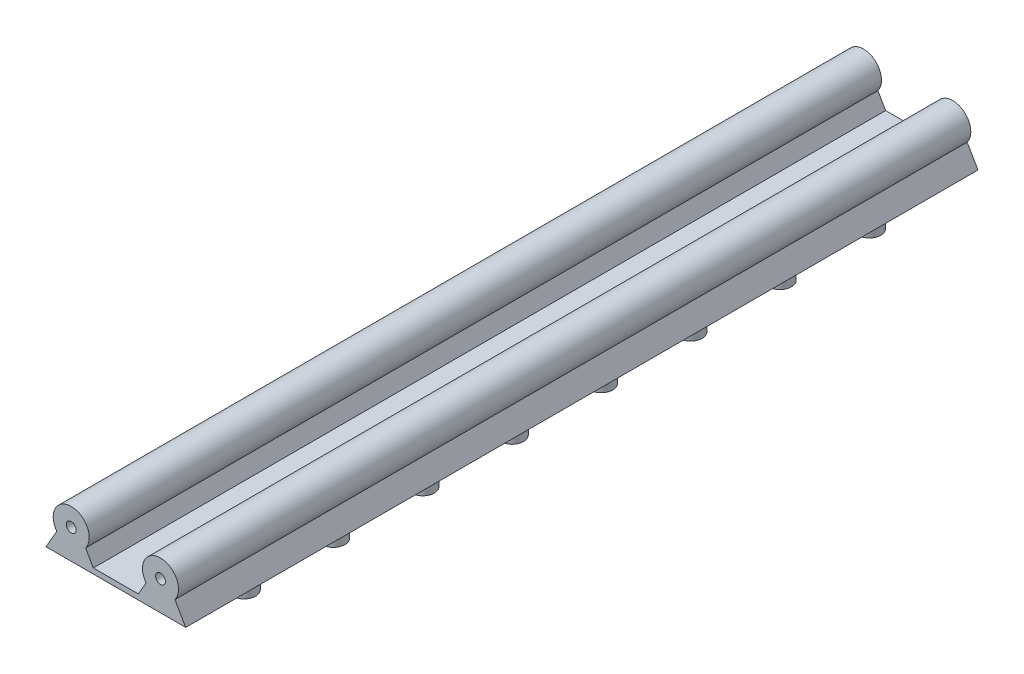
ISO-10303-21;
HEADER;
FILE_DESCRIPTION(('STEP AP214'),'2;1');
FILE_NAME('part.step','',(''),(''),'','','');
FILE_SCHEMA(('AUTOMOTIVE_DESIGN { 1 0 10303 214 1 1 1 1 }'));
ENDSEC;
DATA;
#1=APPLICATION_CONTEXT('core data for automotive mechanical design processes');
#2=APPLICATION_PROTOCOL_DEFINITION('international standard','automotive_design',2000,#1);
#3=PRODUCT_CONTEXT('',#1,'mechanical');
#4=PRODUCT('Part','Part','',(#3));
#5=PRODUCT_RELATED_PRODUCT_CATEGORY('part','',(#4));
#6=PRODUCT_DEFINITION_FORMATION('','',#4);
#7=PRODUCT_DEFINITION_CONTEXT('part definition',#1,'design');
#8=PRODUCT_DEFINITION('design','',#6,#7);
#9=PRODUCT_DEFINITION_SHAPE('','',#8);
#10=(LENGTH_UNIT() NAMED_UNIT(*) SI_UNIT(.MILLI.,.METRE.));
#11=(NAMED_UNIT(*) PLANE_ANGLE_UNIT() SI_UNIT($,.RADIAN.));
#12=(NAMED_UNIT(*) SI_UNIT($,.STERADIAN.) SOLID_ANGLE_UNIT());
#13=UNCERTAINTY_MEASURE_WITH_UNIT(LENGTH_MEASURE(1.E-05),#10,'distance_accuracy_value','');
#14=(GEOMETRIC_REPRESENTATION_CONTEXT(3) GLOBAL_UNCERTAINTY_ASSIGNED_CONTEXT((#13)) GLOBAL_UNIT_ASSIGNED_CONTEXT((#10,
#11,#12)) REPRESENTATION_CONTEXT('',''));
#15=CARTESIAN_POINT('',(0.,0.,0.));
#16=DIRECTION('',(0.,0.,1.));
#17=DIRECTION('',(1.,0.,0.));
#18=AXIS2_PLACEMENT_3D('',#15,#16,#17);
#19=CARTESIAN_POINT('',(0.,0.,220.));
#20=DIRECTION('',(0.,0.,-1.));
#21=DIRECTION('',(-1.,0.,0.));
#22=AXIS2_PLACEMENT_3D('',#19,#20,#21);
#23=CYLINDRICAL_SURFACE('',#22,5.);
#24=CARTESIAN_POINT('',(0.,0.,0.));
#25=DIRECTION('',(0.,0.,1.));
#26=DIRECTION('',(1.,0.,0.));
#27=AXIS2_PLACEMENT_3D('',#24,#25,#26);
#28=CIRCLE('',#27,5.);
#29=CARTESIAN_POINT('',(4.,-3.,0.));
#30=VERTEX_POINT('',#29);
#31=CARTESIAN_POINT('',(-4.,-3.,0.));
#32=VERTEX_POINT('',#31);
#33=EDGE_CURVE('E199',#30,#32,#28,.T.);
#34=ORIENTED_EDGE('',*,*,#33,.T.);
#35=DIRECTION('',(0.,0.,-1.));
#36=VECTOR('',#35,1.);
#37=CARTESIAN_POINT('',(-4.,-3.,220.));
#38=LINE('',#37,#36);
#39=CARTESIAN_POINT('',(-4.,-3.,220.));
#40=VERTEX_POINT('',#39);
#41=EDGE_CURVE('E221',#40,#32,#38,.T.);
#42=ORIENTED_EDGE('',*,*,#41,.F.);
#43=CARTESIAN_POINT('',(0.,0.,220.));
#44=DIRECTION('',(0.,0.,1.));
#45=DIRECTION('',(1.,0.,0.));
#46=AXIS2_PLACEMENT_3D('',#43,#44,#45);
#47=CIRCLE('',#46,5.);
#48=CARTESIAN_POINT('',(4.,-3.,220.));
#49=VERTEX_POINT('',#48);
#50=EDGE_CURVE('E200',#49,#40,#47,.T.);
#51=ORIENTED_EDGE('',*,*,#50,.F.);
#52=DIRECTION('',(0.,0.,-1.));
#53=VECTOR('',#52,1.);
#54=CARTESIAN_POINT('',(4.,-3.,220.));
#55=LINE('',#54,#53);
#56=EDGE_CURVE('E209',#49,#30,#55,.T.);
#57=ORIENTED_EDGE('',*,*,#56,.T.);
#58=EDGE_LOOP('',(#34,#42,#51,#57));
#59=FACE_BOUND('',#58,.T.);
#60=ADVANCED_FACE('F45',(#59),#23,.T.);
#61=CARTESIAN_POINT('',(-1.70096189432334,0.982050807568877,220.));
#62=DIRECTION('',(0.866025403784438,-0.5,0.));
#63=DIRECTION('',(0.5,0.866025403784439,0.));
#64=AXIS2_PLACEMENT_3D('',#61,#62,#63);
#65=PLANE('',#64);
#66=DIRECTION('',(-0.5,-0.866025403784439,0.));
#67=VECTOR('',#66,1.);
#68=CARTESIAN_POINT('',(-1.70096189432334,0.982050807568877,0.));
#69=LINE('',#68,#67);
#70=CARTESIAN_POINT('',(-7.,-8.19615242270663,0.));
#71=VERTEX_POINT('',#70);
#72=EDGE_CURVE('E212',#32,#71,#69,.T.);
#73=ORIENTED_EDGE('',*,*,#72,.T.);
#74=DIRECTION('',(0.,0.,-1.));
#75=VECTOR('',#74,1.);
#76=CARTESIAN_POINT('',(-7.,-8.19615242270663,220.));
#77=LINE('',#76,#75);
#78=CARTESIAN_POINT('',(-7.,-8.19615242270663,220.));
#79=VERTEX_POINT('',#78);
#80=EDGE_CURVE('E218',#79,#71,#77,.T.);
#81=ORIENTED_EDGE('',*,*,#80,.F.);
#82=DIRECTION('',(-0.5,-0.866025403784439,0.));
#83=VECTOR('',#82,1.);
#84=CARTESIAN_POINT('',(-1.70096189432334,0.982050807568877,220.));
#85=LINE('',#84,#83);
#86=EDGE_CURVE('E203',#40,#79,#85,.T.);
#87=ORIENTED_EDGE('',*,*,#86,.F.);
#88=ORIENTED_EDGE('',*,*,#41,.T.);
#89=EDGE_LOOP('',(#73,#81,#87,#88));
#90=FACE_BOUND('',#89,.T.);
#91=ADVANCED_FACE('F250',(#90),#65,.F.);
#92=CARTESIAN_POINT('',(0.,-8.19615242270663,220.));
#93=DIRECTION('',(0.,1.,0.));
#94=DIRECTION('',(0.,0.,1.));
#95=AXIS2_PLACEMENT_3D('',#92,#93,#94);
#96=PLANE('',#95);
#97=DIRECTION('',(0.,0.,-1.));
#98=VECTOR('',#97,1.);
#99=CARTESIAN_POINT('',(31.8,-8.19615242270663,220.));
#100=LINE('',#99,#98);
#101=CARTESIAN_POINT('',(31.8,-8.19615242270663,220.));
#102=VERTEX_POINT('',#101);
#103=CARTESIAN_POINT('',(31.8,-8.19615242270663,0.));
#104=VERTEX_POINT('',#103);
#105=EDGE_CURVE('E119',#102,#104,#100,.T.);
#106=ORIENTED_EDGE('',*,*,#105,.F.);
#107=DIRECTION('',(1.,0.,0.));
#108=VECTOR('',#107,1.);
#109=CARTESIAN_POINT('',(0.,-8.19615242270663,220.));
#110=LINE('',#109,#108);
#111=EDGE_CURVE('E206',#79,#102,#110,.T.);
#112=ORIENTED_EDGE('',*,*,#111,.F.);
#113=ORIENTED_EDGE('',*,*,#80,.T.);
#114=DIRECTION('',(1.,0.,0.));
#115=VECTOR('',#114,1.);
#116=CARTESIAN_POINT('',(0.,-8.19615242270663,0.));
#117=LINE('',#116,#115);
#118=EDGE_CURVE('E214',#71,#104,#117,.T.);
#119=ORIENTED_EDGE('',*,*,#118,.T.);
#120=EDGE_LOOP('',(#106,#112,#113,#119));
#121=FACE_BOUND('',#120,.T.);
#122=CARTESIAN_POINT('',(24.8000000000018,-8.19615242270663,23.2000000000003));
#123=DIRECTION('',(0.,1.,0.));
#124=DIRECTION('',(0.,0.,1.));
#125=AXIS2_PLACEMENT_3D('',#122,#123,#124);
#126=CIRCLE('',#125,3.2);
#127=CARTESIAN_POINT('',(24.8000000000018,-8.19615242270663,26.4000000000003));
#128=VERTEX_POINT('',#127);
#129=EDGE_CURVE('E165',#128,#128,#126,.F.);
#130=ORIENTED_EDGE('',*,*,#129,.F.);
#131=EDGE_LOOP('',(#130));
#132=FACE_BOUND('',#131,.T.);
#133=CARTESIAN_POINT('',(24.8000000000015,-8.19615242270663,48.0000000000003));
#134=DIRECTION('',(0.,1.,0.));
#135=DIRECTION('',(0.,0.,1.));
#136=AXIS2_PLACEMENT_3D('',#133,#134,#135);
#137=CIRCLE('',#136,3.2);
#138=CARTESIAN_POINT('',(24.8000000000015,-8.19615242270663,51.2000000000003));
#139=VERTEX_POINT('',#138);
#140=EDGE_CURVE('E162',#139,#139,#137,.F.);
#141=ORIENTED_EDGE('',*,*,#140,.F.);
#142=EDGE_LOOP('',(#141));
#143=FACE_BOUND('',#142,.T.);
#144=CARTESIAN_POINT('',(24.8000000000013,-8.19615242270663,72.8000000000003));
#145=DIRECTION('',(0.,1.,0.));
#146=DIRECTION('',(0.,0.,1.));
#147=AXIS2_PLACEMENT_3D('',#144,#145,#146);
#148=CIRCLE('',#147,3.2);
#149=CARTESIAN_POINT('',(24.8000000000013,-8.19615242270663,76.0000000000003));
#150=VERTEX_POINT('',#149);
#151=EDGE_CURVE('E159',#150,#150,#148,.F.);
#152=ORIENTED_EDGE('',*,*,#151,.F.);
#153=EDGE_LOOP('',(#152));
#154=FACE_BOUND('',#153,.T.);
#155=CARTESIAN_POINT('',(24.800000000001,-8.19615242270663,97.6000000000003));
#156=DIRECTION('',(0.,1.,0.));
#157=DIRECTION('',(0.,0.,1.));
#158=AXIS2_PLACEMENT_3D('',#155,#156,#157);
#159=CIRCLE('',#158,3.2);
#160=CARTESIAN_POINT('',(24.800000000001,-8.19615242270663,100.8));
#161=VERTEX_POINT('',#160);
#162=EDGE_CURVE('E156',#161,#161,#159,.F.);
#163=ORIENTED_EDGE('',*,*,#162,.F.);
#164=EDGE_LOOP('',(#163));
#165=FACE_BOUND('',#164,.T.);
#166=CARTESIAN_POINT('',(24.8000000000008,-8.19615242270663,122.4));
#167=DIRECTION('',(0.,1.,0.));
#168=DIRECTION('',(0.,0.,1.));
#169=AXIS2_PLACEMENT_3D('',#166,#167,#168);
#170=CIRCLE('',#169,3.19999999999999);
#171=CARTESIAN_POINT('',(24.8000000000008,-8.19615242270663,125.6));
#172=VERTEX_POINT('',#171);
#173=EDGE_CURVE('E153',#172,#172,#170,.F.);
#174=ORIENTED_EDGE('',*,*,#173,.F.);
#175=EDGE_LOOP('',(#174));
#176=FACE_BOUND('',#175,.T.);
#177=CARTESIAN_POINT('',(24.8000000000005,-8.19615242270663,147.2));
#178=DIRECTION('',(0.,1.,0.));
#179=DIRECTION('',(0.,0.,1.));
#180=AXIS2_PLACEMENT_3D('',#177,#178,#179);
#181=CIRCLE('',#180,3.20000000000001);
#182=CARTESIAN_POINT('',(24.8000000000005,-8.19615242270663,150.4));
#183=VERTEX_POINT('',#182);
#184=EDGE_CURVE('E150',#183,#183,#181,.F.);
#185=ORIENTED_EDGE('',*,*,#184,.F.);
#186=EDGE_LOOP('',(#185));
#187=FACE_BOUND('',#186,.T.);
#188=CARTESIAN_POINT('',(24.8000000000003,-8.19615242270663,172.));
#189=DIRECTION('',(0.,1.,0.));
#190=DIRECTION('',(0.,0.,1.));
#191=AXIS2_PLACEMENT_3D('',#188,#189,#190);
#192=CIRCLE('',#191,3.2);
#193=CARTESIAN_POINT('',(24.8000000000003,-8.19615242270663,175.2));
#194=VERTEX_POINT('',#193);
#195=EDGE_CURVE('E139',#194,#194,#192,.F.);
#196=ORIENTED_EDGE('',*,*,#195,.F.);
#197=EDGE_LOOP('',(#196));
#198=FACE_BOUND('',#197,.T.);
#199=CARTESIAN_POINT('',(24.8,-8.19615242270663,196.8));
#200=DIRECTION('',(0.,1.,0.));
#201=DIRECTION('',(0.,0.,1.));
#202=AXIS2_PLACEMENT_3D('',#199,#200,#201);
#203=CIRCLE('',#202,3.2);
#204=CARTESIAN_POINT('',(24.8,-8.19615242270663,200.));
#205=VERTEX_POINT('',#204);
#206=EDGE_CURVE('E136',#205,#205,#203,.F.);
#207=ORIENTED_EDGE('',*,*,#206,.F.);
#208=EDGE_LOOP('',(#207));
#209=FACE_BOUND('',#208,.T.);
#210=CARTESIAN_POINT('',(0.,-8.19615242270663,196.8));
#211=DIRECTION('',(0.,1.,0.));
#212=DIRECTION('',(0.,0.,1.));
#213=AXIS2_PLACEMENT_3D('',#210,#211,#212);
#214=CIRCLE('',#213,3.20000000000001);
#215=CARTESIAN_POINT('',(0.,-8.19615242270663,200.));
#216=VERTEX_POINT('',#215);
#217=EDGE_CURVE('E224',#216,#216,#214,.F.);
#218=ORIENTED_EDGE('',*,*,#217,.F.);
#219=EDGE_LOOP('',(#218));
#220=FACE_BOUND('',#219,.T.);
#221=CARTESIAN_POINT('',(2.58247649578986E-13,-8.19615242270663,172.));
#222=DIRECTION('',(0.,1.,0.));
#223=DIRECTION('',(0.,0.,1.));
#224=AXIS2_PLACEMENT_3D('',#221,#222,#223);
#225=CIRCLE('',#224,3.20000000000001);
#226=CARTESIAN_POINT('',(2.58247649578986E-13,-8.19615242270663,175.2));
#227=VERTEX_POINT('',#226);
#228=EDGE_CURVE('E227',#227,#227,#225,.F.);
#229=ORIENTED_EDGE('',*,*,#228,.F.);
#230=EDGE_LOOP('',(#229));
#231=FACE_BOUND('',#230,.T.);
#232=CARTESIAN_POINT('',(5.16495299157972E-13,-8.19615242270663,147.2));
#233=DIRECTION('',(0.,1.,0.));
#234=DIRECTION('',(0.,0.,1.));
#235=AXIS2_PLACEMENT_3D('',#232,#233,#234);
#236=CIRCLE('',#235,3.20000000000001);
#237=CARTESIAN_POINT('',(5.16495299157972E-13,-8.19615242270663,150.4));
#238=VERTEX_POINT('',#237);
#239=EDGE_CURVE('E230',#238,#238,#236,.F.);
#240=ORIENTED_EDGE('',*,*,#239,.F.);
#241=EDGE_LOOP('',(#240));
#242=FACE_BOUND('',#241,.T.);
#243=CARTESIAN_POINT('',(7.74742948736958E-13,-8.19615242270663,122.4));
#244=DIRECTION('',(0.,1.,0.));
#245=DIRECTION('',(0.,0.,1.));
#246=AXIS2_PLACEMENT_3D('',#243,#244,#245);
#247=CIRCLE('',#246,3.2);
#248=CARTESIAN_POINT('',(7.74742948736958E-13,-8.19615242270663,125.6));
#249=VERTEX_POINT('',#248);
#250=EDGE_CURVE('E233',#249,#249,#247,.F.);
#251=ORIENTED_EDGE('',*,*,#250,.F.);
#252=EDGE_LOOP('',(#251));
#253=FACE_BOUND('',#252,.T.);
#254=CARTESIAN_POINT('',(1.03299059831594E-12,-8.19615242270663,97.5999999999999));
#255=DIRECTION('',(0.,1.,0.));
#256=DIRECTION('',(0.,0.,1.));
#257=AXIS2_PLACEMENT_3D('',#254,#255,#256);
#258=CIRCLE('',#257,3.2);
#259=CARTESIAN_POINT('',(1.03299059831594E-12,-8.19615242270663,100.8));
#260=VERTEX_POINT('',#259);
#261=EDGE_CURVE('E236',#260,#260,#258,.F.);
#262=ORIENTED_EDGE('',*,*,#261,.F.);
#263=EDGE_LOOP('',(#262));
#264=FACE_BOUND('',#263,.T.);
#265=CARTESIAN_POINT('',(1.29123824789493E-12,-8.19615242270663,72.7999999999999));
#266=DIRECTION('',(0.,1.,0.));
#267=DIRECTION('',(0.,0.,1.));
#268=AXIS2_PLACEMENT_3D('',#265,#266,#267);
#269=CIRCLE('',#268,3.2);
#270=CARTESIAN_POINT('',(1.29123824789493E-12,-8.19615242270663,75.9999999999999));
#271=VERTEX_POINT('',#270);
#272=EDGE_CURVE('E239',#271,#271,#269,.F.);
#273=ORIENTED_EDGE('',*,*,#272,.F.);
#274=EDGE_LOOP('',(#273));
#275=FACE_BOUND('',#274,.T.);
#276=CARTESIAN_POINT('',(1.54948589747392E-12,-8.19615242270663,48.));
#277=DIRECTION('',(0.,1.,0.));
#278=DIRECTION('',(0.,0.,1.));
#279=AXIS2_PLACEMENT_3D('',#276,#277,#278);
#280=CIRCLE('',#279,3.2);
#281=CARTESIAN_POINT('',(1.54948589747392E-12,-8.19615242270663,51.2));
#282=VERTEX_POINT('',#281);
#283=EDGE_CURVE('E52',#282,#282,#280,.F.);
#284=ORIENTED_EDGE('',*,*,#283,.F.);
#285=EDGE_LOOP('',(#284));
#286=FACE_BOUND('',#285,.T.);
#287=CARTESIAN_POINT('',(1.8077335470529E-12,-8.19615242270663,23.2));
#288=DIRECTION('',(0.,1.,0.));
#289=DIRECTION('',(0.,0.,1.));
#290=AXIS2_PLACEMENT_3D('',#287,#288,#289);
#291=CIRCLE('',#290,3.2);
#292=CARTESIAN_POINT('',(1.8077335470529E-12,-8.19615242270663,26.4));
#293=VERTEX_POINT('',#292);
#294=EDGE_CURVE('E11',#293,#293,#291,.F.);
#295=ORIENTED_EDGE('',*,*,#294,.F.);
#296=EDGE_LOOP('',(#295));
#297=FACE_BOUND('',#296,.T.);
#298=ADVANCED_FACE('F246',(#121,#132,#143,#154,#165,#176,#187,#198,#209,#220,#231,#242,#253,
#264,#275,#286,#297),#96,.F.);
#299=CARTESIAN_POINT('',(1.70096189432334,0.982050807568877,220.));
#300=DIRECTION('',(0.866025403784438,0.5,0.));
#301=DIRECTION('',(-0.5,0.866025403784439,0.));
#302=AXIS2_PLACEMENT_3D('',#299,#300,#301);
#303=PLANE('',#302);
#304=DIRECTION('',(0.,0.,1.));
#305=VECTOR('',#304,1.);
#306=CARTESIAN_POINT('',(6.15,-6.72390923627308,0.));
#307=LINE('',#306,#305);
#308=CARTESIAN_POINT('',(6.15,-6.72390923627308,0.));
#309=VERTEX_POINT('',#308);
#310=CARTESIAN_POINT('',(6.15,-6.72390923627308,220.));
#311=VERTEX_POINT('',#310);
#312=EDGE_CURVE('E63',#309,#311,#307,.T.);
#313=ORIENTED_EDGE('',*,*,#312,.F.);
#314=DIRECTION('',(0.5,-0.866025403784439,0.));
#315=VECTOR('',#314,1.);
#316=CARTESIAN_POINT('',(1.70096189432334,0.982050807568877,0.));
#317=LINE('',#316,#315);
#318=EDGE_CURVE('E204',#30,#309,#317,.T.);
#319=ORIENTED_EDGE('',*,*,#318,.F.);
#320=ORIENTED_EDGE('',*,*,#56,.F.);
#321=DIRECTION('',(0.5,-0.866025403784439,0.));
#322=VECTOR('',#321,1.);
#323=CARTESIAN_POINT('',(1.70096189432334,0.982050807568877,220.));
#324=LINE('',#323,#322);
#325=EDGE_CURVE('E59',#49,#311,#324,.T.);
#326=ORIENTED_EDGE('',*,*,#325,.T.);
#327=EDGE_LOOP('',(#313,#319,#320,#326));
#328=FACE_BOUND('',#327,.T.);
#329=ADVANCED_FACE('F249',(#328),#303,.T.);
#330=CARTESIAN_POINT('',(0.,0.,220.));
#331=DIRECTION('',(0.,0.,1.));
#332=DIRECTION('',(1.,0.,0.));
#333=AXIS2_PLACEMENT_3D('',#330,#331,#332);
#334=PLANE('',#333);
#335=CARTESIAN_POINT('',(0.,0.,220.));
#336=DIRECTION('',(0.,0.,1.));
#337=DIRECTION('',(1.,0.,0.));
#338=AXIS2_PLACEMENT_3D('',#335,#336,#337);
#339=CIRCLE('',#338,1.37);
#340=CARTESIAN_POINT('',(1.37,0.,220.));
#341=VERTEX_POINT('',#340);
#342=EDGE_CURVE('E399',#341,#341,#339,.T.);
#343=ORIENTED_EDGE('',*,*,#342,.F.);
#344=EDGE_LOOP('',(#343));
#345=FACE_BOUND('',#344,.T.);
#346=CARTESIAN_POINT('',(24.8,0.,220.));
#347=DIRECTION('',(0.,0.,1.));
#348=DIRECTION('',(1.,0.,0.));
#349=AXIS2_PLACEMENT_3D('',#346,#347,#348);
#350=CIRCLE('',#349,1.37);
#351=CARTESIAN_POINT('',(26.17,0.,220.));
#352=VERTEX_POINT('',#351);
#353=EDGE_CURVE('E405',#352,#352,#350,.T.);
#354=ORIENTED_EDGE('',*,*,#353,.F.);
#355=EDGE_LOOP('',(#354));
#356=FACE_BOUND('',#355,.T.);
#357=DIRECTION('',(-0.5,-0.866025403784439,0.));
#358=VECTOR('',#357,1.);
#359=CARTESIAN_POINT('',(20.8,-3.,220.));
#360=LINE('',#359,#358);
#361=CARTESIAN_POINT('',(20.8,-3.,220.));
#362=VERTEX_POINT('',#361);
#363=CARTESIAN_POINT('',(18.65,-6.72390923627309,220.));
#364=VERTEX_POINT('',#363);
#365=EDGE_CURVE('E114',#362,#364,#360,.T.);
#366=ORIENTED_EDGE('',*,*,#365,.T.);
#367=DIRECTION('',(-1.,0.,0.));
#368=VECTOR('',#367,1.);
#369=CARTESIAN_POINT('',(6.15,-6.72390923627308,220.));
#370=LINE('',#369,#368);
#371=EDGE_CURVE('E168',#364,#311,#370,.T.);
#372=ORIENTED_EDGE('',*,*,#371,.T.);
#373=ORIENTED_EDGE('',*,*,#325,.F.);
#374=ORIENTED_EDGE('',*,*,#50,.T.);
#375=ORIENTED_EDGE('',*,*,#86,.T.);
#376=ORIENTED_EDGE('',*,*,#111,.T.);
#377=DIRECTION('',(0.5,-0.866025403784438,0.));
#378=VECTOR('',#377,1.);
#379=CARTESIAN_POINT('',(28.8,-3.,220.));
#380=LINE('',#379,#378);
#381=CARTESIAN_POINT('',(28.8,-3.,220.));
#382=VERTEX_POINT('',#381);
#383=EDGE_CURVE('E144',#382,#102,#380,.T.);
#384=ORIENTED_EDGE('',*,*,#383,.F.);
#385=CARTESIAN_POINT('',(24.8,0.,220.));
#386=DIRECTION('',(0.,0.,-1.));
#387=DIRECTION('',(-1.,0.,0.));
#388=AXIS2_PLACEMENT_3D('',#385,#386,#387);
#389=CIRCLE('',#388,5.);
#390=EDGE_CURVE('E131',#362,#382,#389,.T.);
#391=ORIENTED_EDGE('',*,*,#390,.F.);
#392=EDGE_LOOP('',(#366,#372,#373,#374,#375,#376,#384,#391));
#393=FACE_BOUND('',#392,.T.);
#394=ADVANCED_FACE('F283',(#345,#356,#393),#334,.T.);
#395=CARTESIAN_POINT('',(0.,0.,0.));
#396=DIRECTION('',(0.,0.,1.));
#397=DIRECTION('',(1.,0.,0.));
#398=AXIS2_PLACEMENT_3D('',#395,#396,#397);
#399=PLANE('',#398);
#400=CARTESIAN_POINT('',(0.,0.,0.));
#401=DIRECTION('',(0.,0.,-1.));
#402=DIRECTION('',(-1.,0.,0.));
#403=AXIS2_PLACEMENT_3D('',#400,#401,#402);
#404=CIRCLE('',#403,1.37);
#405=CARTESIAN_POINT('',(-1.37,0.,0.));
#406=VERTEX_POINT('',#405);
#407=EDGE_CURVE('E417',#406,#406,#404,.T.);
#408=ORIENTED_EDGE('',*,*,#407,.F.);
#409=EDGE_LOOP('',(#408));
#410=FACE_BOUND('',#409,.T.);
#411=CARTESIAN_POINT('',(24.8,-1.73177474406619E-13,0.));
#412=DIRECTION('',(0.,0.,-1.));
#413=DIRECTION('',(-1.,0.,0.));
#414=AXIS2_PLACEMENT_3D('',#411,#412,#413);
#415=CIRCLE('',#414,1.37);
#416=CARTESIAN_POINT('',(23.43,-1.73177474406619E-13,0.));
#417=VERTEX_POINT('',#416);
#418=EDGE_CURVE('E402',#417,#417,#415,.T.);
#419=ORIENTED_EDGE('',*,*,#418,.F.);
#420=EDGE_LOOP('',(#419));
#421=FACE_BOUND('',#420,.T.);
#422=DIRECTION('',(0.5,-0.866025403784438,0.));
#423=VECTOR('',#422,1.);
#424=CARTESIAN_POINT('',(28.8,-3.,0.));
#425=LINE('',#424,#423);
#426=CARTESIAN_POINT('',(28.8,-3.,0.));
#427=VERTEX_POINT('',#426);
#428=EDGE_CURVE('E130',#427,#104,#425,.T.);
#429=ORIENTED_EDGE('',*,*,#428,.T.);
#430=ORIENTED_EDGE('',*,*,#118,.F.);
#431=ORIENTED_EDGE('',*,*,#72,.F.);
#432=ORIENTED_EDGE('',*,*,#33,.F.);
#433=ORIENTED_EDGE('',*,*,#318,.T.);
#434=DIRECTION('',(-1.,0.,0.));
#435=VECTOR('',#434,1.);
#436=CARTESIAN_POINT('',(6.15,-6.72390923627308,0.));
#437=LINE('',#436,#435);
#438=CARTESIAN_POINT('',(18.65,-6.72390923627309,0.));
#439=VERTEX_POINT('',#438);
#440=EDGE_CURVE('E128',#439,#309,#437,.T.);
#441=ORIENTED_EDGE('',*,*,#440,.F.);
#442=DIRECTION('',(-0.5,-0.866025403784439,0.));
#443=VECTOR('',#442,1.);
#444=CARTESIAN_POINT('',(20.8,-3.,0.));
#445=LINE('',#444,#443);
#446=CARTESIAN_POINT('',(20.8,-3.,0.));
#447=VERTEX_POINT('',#446);
#448=EDGE_CURVE('E112',#447,#439,#445,.T.);
#449=ORIENTED_EDGE('',*,*,#448,.F.);
#450=CARTESIAN_POINT('',(24.8,0.,0.));
#451=DIRECTION('',(0.,0.,-1.));
#452=DIRECTION('',(-1.,0.,0.));
#453=AXIS2_PLACEMENT_3D('',#450,#451,#452);
#454=CIRCLE('',#453,5.);
#455=EDGE_CURVE('E126',#447,#427,#454,.T.);
#456=ORIENTED_EDGE('',*,*,#455,.T.);
#457=EDGE_LOOP('',(#429,#430,#431,#432,#433,#441,#449,#456));
#458=FACE_BOUND('',#457,.T.);
#459=ADVANCED_FACE('F125',(#410,#421,#458),#399,.F.);
#460=CARTESIAN_POINT('',(0.,-14.1961524227066,196.8));
#461=DIRECTION('',(0.,1.,0.));
#462=DIRECTION('',(0.,0.,1.));
#463=AXIS2_PLACEMENT_3D('',#460,#461,#462);
#464=CYLINDRICAL_SURFACE('',#463,3.20000000000001);
#465=CARTESIAN_POINT('',(0.,-14.1961524227066,196.8));
#466=DIRECTION('',(0.,-1.,0.));
#467=DIRECTION('',(0.,0.,-1.));
#468=AXIS2_PLACEMENT_3D('',#465,#466,#467);
#469=CIRCLE('',#468,3.20000000000001);
#470=CARTESIAN_POINT('',(0.,-14.1961524227066,193.6));
#471=VERTEX_POINT('',#470);
#472=EDGE_CURVE('E196',#471,#471,#469,.T.);
#473=ORIENTED_EDGE('',*,*,#472,.F.);
#474=EDGE_LOOP('',(#473));
#475=FACE_BOUND('',#474,.T.);
#476=ORIENTED_EDGE('',*,*,#217,.T.);
#477=EDGE_LOOP('',(#476));
#478=FACE_BOUND('',#477,.T.);
#479=ADVANCED_FACE('F527',(#475,#478),#464,.T.);
#480=CARTESIAN_POINT('',(0.,-14.1961524227066,196.8));
#481=DIRECTION('',(0.,-1.,0.));
#482=DIRECTION('',(0.,0.,-1.));
#483=AXIS2_PLACEMENT_3D('',#480,#481,#482);
#484=PLANE('',#483);
#485=ORIENTED_EDGE('',*,*,#472,.T.);
#486=EDGE_LOOP('',(#485));
#487=FACE_BOUND('',#486,.T.);
#488=ADVANCED_FACE('F520',(#487),#484,.T.);
#489=CARTESIAN_POINT('',(2.58247649578986E-13,-14.1961524227066,172.));
#490=DIRECTION('',(0.,1.,0.));
#491=DIRECTION('',(0.,0.,1.));
#492=AXIS2_PLACEMENT_3D('',#489,#490,#491);
#493=CYLINDRICAL_SURFACE('',#492,3.20000000000001);
#494=CARTESIAN_POINT('',(2.58247649578986E-13,-14.1961524227066,172.));
#495=DIRECTION('',(0.,-1.,0.));
#496=DIRECTION('',(0.,0.,-1.));
#497=AXIS2_PLACEMENT_3D('',#494,#495,#496);
#498=CIRCLE('',#497,3.20000000000001);
#499=CARTESIAN_POINT('',(2.58247649578986E-13,-14.1961524227066,168.8));
#500=VERTEX_POINT('',#499);
#501=EDGE_CURVE('E193',#500,#500,#498,.T.);
#502=ORIENTED_EDGE('',*,*,#501,.F.);
#503=EDGE_LOOP('',(#502));
#504=FACE_BOUND('',#503,.T.);
#505=ORIENTED_EDGE('',*,*,#228,.T.);
#506=EDGE_LOOP('',(#505));
#507=FACE_BOUND('',#506,.T.);
#508=ADVANCED_FACE('F517',(#504,#507),#493,.T.);
#509=CARTESIAN_POINT('',(2.58247649578986E-13,-14.1961524227066,172.));
#510=DIRECTION('',(0.,-1.,0.));
#511=DIRECTION('',(0.,0.,-1.));
#512=AXIS2_PLACEMENT_3D('',#509,#510,#511);
#513=PLANE('',#512);
#514=ORIENTED_EDGE('',*,*,#501,.T.);
#515=EDGE_LOOP('',(#514));
#516=FACE_BOUND('',#515,.T.);
#517=ADVANCED_FACE('F512',(#516),#513,.T.);
#518=CARTESIAN_POINT('',(5.16495299157972E-13,-14.1961524227066,147.2));
#519=DIRECTION('',(0.,1.,0.));
#520=DIRECTION('',(0.,0.,1.));
#521=AXIS2_PLACEMENT_3D('',#518,#519,#520);
#522=CYLINDRICAL_SURFACE('',#521,3.20000000000001);
#523=CARTESIAN_POINT('',(5.16495299157972E-13,-14.1961524227066,147.2));
#524=DIRECTION('',(0.,-1.,0.));
#525=DIRECTION('',(0.,0.,-1.));
#526=AXIS2_PLACEMENT_3D('',#523,#524,#525);
#527=CIRCLE('',#526,3.20000000000001);
#528=CARTESIAN_POINT('',(5.16495299157972E-13,-14.1961524227066,144.));
#529=VERTEX_POINT('',#528);
#530=EDGE_CURVE('E190',#529,#529,#527,.T.);
#531=ORIENTED_EDGE('',*,*,#530,.F.);
#532=EDGE_LOOP('',(#531));
#533=FACE_BOUND('',#532,.T.);
#534=ORIENTED_EDGE('',*,*,#239,.T.);
#535=EDGE_LOOP('',(#534));
#536=FACE_BOUND('',#535,.T.);
#537=ADVANCED_FACE('F509',(#533,#536),#522,.T.);
#538=CARTESIAN_POINT('',(5.16495299157972E-13,-14.1961524227066,147.2));
#539=DIRECTION('',(0.,-1.,0.));
#540=DIRECTION('',(0.,0.,-1.));
#541=AXIS2_PLACEMENT_3D('',#538,#539,#540);
#542=PLANE('',#541);
#543=ORIENTED_EDGE('',*,*,#530,.T.);
#544=EDGE_LOOP('',(#543));
#545=FACE_BOUND('',#544,.T.);
#546=ADVANCED_FACE('F504',(#545),#542,.T.);
#547=CARTESIAN_POINT('',(7.74742948736958E-13,-14.1961524227066,122.4));
#548=DIRECTION('',(0.,1.,0.));
#549=DIRECTION('',(0.,0.,1.));
#550=AXIS2_PLACEMENT_3D('',#547,#548,#549);
#551=CYLINDRICAL_SURFACE('',#550,3.2);
#552=CARTESIAN_POINT('',(7.74742948736958E-13,-14.1961524227066,122.4));
#553=DIRECTION('',(0.,-1.,0.));
#554=DIRECTION('',(0.,0.,-1.));
#555=AXIS2_PLACEMENT_3D('',#552,#553,#554);
#556=CIRCLE('',#555,3.2);
#557=CARTESIAN_POINT('',(7.74742948736958E-13,-14.1961524227066,119.2));
#558=VERTEX_POINT('',#557);
#559=EDGE_CURVE('E187',#558,#558,#556,.T.);
#560=ORIENTED_EDGE('',*,*,#559,.F.);
#561=EDGE_LOOP('',(#560));
#562=FACE_BOUND('',#561,.T.);
#563=ORIENTED_EDGE('',*,*,#250,.T.);
#564=EDGE_LOOP('',(#563));
#565=FACE_BOUND('',#564,.T.);
#566=ADVANCED_FACE('F501',(#562,#565),#551,.T.);
#567=CARTESIAN_POINT('',(7.74742948736958E-13,-14.1961524227066,122.4));
#568=DIRECTION('',(0.,-1.,0.));
#569=DIRECTION('',(0.,0.,-1.));
#570=AXIS2_PLACEMENT_3D('',#567,#568,#569);
#571=PLANE('',#570);
#572=ORIENTED_EDGE('',*,*,#559,.T.);
#573=EDGE_LOOP('',(#572));
#574=FACE_BOUND('',#573,.T.);
#575=ADVANCED_FACE('F498',(#574),#571,.T.);
#576=CARTESIAN_POINT('',(1.03299059831594E-12,-14.1961524227066,97.5999999999999));
#577=DIRECTION('',(0.,1.,0.));
#578=DIRECTION('',(0.,0.,1.));
#579=AXIS2_PLACEMENT_3D('',#576,#577,#578);
#580=CYLINDRICAL_SURFACE('',#579,3.2);
#581=CARTESIAN_POINT('',(1.03299059831594E-12,-14.1961524227066,97.5999999999999));
#582=DIRECTION('',(0.,-1.,0.));
#583=DIRECTION('',(0.,0.,-1.));
#584=AXIS2_PLACEMENT_3D('',#581,#582,#583);
#585=CIRCLE('',#584,3.2);
#586=CARTESIAN_POINT('',(1.03299059831594E-12,-14.1961524227066,94.3999999999999));
#587=VERTEX_POINT('',#586);
#588=EDGE_CURVE('E184',#587,#587,#585,.T.);
#589=ORIENTED_EDGE('',*,*,#588,.F.);
#590=EDGE_LOOP('',(#589));
#591=FACE_BOUND('',#590,.T.);
#592=ORIENTED_EDGE('',*,*,#261,.T.);
#593=EDGE_LOOP('',(#592));
#594=FACE_BOUND('',#593,.T.);
#595=ADVANCED_FACE('F491',(#591,#594),#580,.T.);
#596=CARTESIAN_POINT('',(1.03299059831594E-12,-14.1961524227066,97.5999999999999));
#597=DIRECTION('',(0.,-1.,0.));
#598=DIRECTION('',(0.,0.,-1.));
#599=AXIS2_PLACEMENT_3D('',#596,#597,#598);
#600=PLANE('',#599);
#601=ORIENTED_EDGE('',*,*,#588,.T.);
#602=EDGE_LOOP('',(#601));
#603=FACE_BOUND('',#602,.T.);
#604=ADVANCED_FACE('F482',(#603),#600,.T.);
#605=CARTESIAN_POINT('',(1.29123824789493E-12,-14.1961524227066,72.7999999999999));
#606=DIRECTION('',(0.,1.,0.));
#607=DIRECTION('',(0.,0.,1.));
#608=AXIS2_PLACEMENT_3D('',#605,#606,#607);
#609=CYLINDRICAL_SURFACE('',#608,3.2);
#610=CARTESIAN_POINT('',(1.29123824789493E-12,-14.1961524227066,72.7999999999999));
#611=DIRECTION('',(0.,-1.,0.));
#612=DIRECTION('',(0.,0.,-1.));
#613=AXIS2_PLACEMENT_3D('',#610,#611,#612);
#614=CIRCLE('',#613,3.2);
#615=CARTESIAN_POINT('',(1.29123824789493E-12,-14.1961524227066,69.5999999999999));
#616=VERTEX_POINT('',#615);
#617=EDGE_CURVE('E181',#616,#616,#614,.T.);
#618=ORIENTED_EDGE('',*,*,#617,.F.);
#619=EDGE_LOOP('',(#618));
#620=FACE_BOUND('',#619,.T.);
#621=ORIENTED_EDGE('',*,*,#272,.T.);
#622=EDGE_LOOP('',(#621));
#623=FACE_BOUND('',#622,.T.);
#624=ADVANCED_FACE('F479',(#620,#623),#609,.T.);
#625=CARTESIAN_POINT('',(1.29123824789493E-12,-14.1961524227066,72.7999999999999));
#626=DIRECTION('',(0.,-1.,0.));
#627=DIRECTION('',(0.,0.,-1.));
#628=AXIS2_PLACEMENT_3D('',#625,#626,#627);
#629=PLANE('',#628);
#630=ORIENTED_EDGE('',*,*,#617,.T.);
#631=EDGE_LOOP('',(#630));
#632=FACE_BOUND('',#631,.T.);
#633=ADVANCED_FACE('F481',(#632),#629,.T.);
#634=CARTESIAN_POINT('',(1.54948589747392E-12,-14.1961524227066,48.));
#635=DIRECTION('',(0.,1.,0.));
#636=DIRECTION('',(0.,0.,1.));
#637=AXIS2_PLACEMENT_3D('',#634,#635,#636);
#638=CYLINDRICAL_SURFACE('',#637,3.2);
#639=CARTESIAN_POINT('',(1.54948589747392E-12,-14.1961524227066,48.));
#640=DIRECTION('',(0.,-1.,0.));
#641=DIRECTION('',(0.,0.,-1.));
#642=AXIS2_PLACEMENT_3D('',#639,#640,#641);
#643=CIRCLE('',#642,3.2);
#644=CARTESIAN_POINT('',(1.54948589747392E-12,-14.1961524227066,44.8));
#645=VERTEX_POINT('',#644);
#646=EDGE_CURVE('E178',#645,#645,#643,.T.);
#647=ORIENTED_EDGE('',*,*,#646,.F.);
#648=EDGE_LOOP('',(#647));
#649=FACE_BOUND('',#648,.T.);
#650=ORIENTED_EDGE('',*,*,#283,.T.);
#651=EDGE_LOOP('',(#650));
#652=FACE_BOUND('',#651,.T.);
#653=ADVANCED_FACE('F244',(#649,#652),#638,.T.);
#654=CARTESIAN_POINT('',(1.54948589747392E-12,-14.1961524227066,48.));
#655=DIRECTION('',(0.,-1.,0.));
#656=DIRECTION('',(0.,0.,-1.));
#657=AXIS2_PLACEMENT_3D('',#654,#655,#656);
#658=PLANE('',#657);
#659=ORIENTED_EDGE('',*,*,#646,.T.);
#660=EDGE_LOOP('',(#659));
#661=FACE_BOUND('',#660,.T.);
#662=ADVANCED_FACE('F258',(#661),#658,.T.);
#663=CARTESIAN_POINT('',(1.8077335470529E-12,-14.1961524227066,23.2));
#664=DIRECTION('',(0.,1.,0.));
#665=DIRECTION('',(0.,0.,1.));
#666=AXIS2_PLACEMENT_3D('',#663,#664,#665);
#667=CYLINDRICAL_SURFACE('',#666,3.2);
#668=CARTESIAN_POINT('',(1.8077335470529E-12,-14.1961524227066,23.2));
#669=DIRECTION('',(0.,-1.,0.));
#670=DIRECTION('',(0.,0.,-1.));
#671=AXIS2_PLACEMENT_3D('',#668,#669,#670);
#672=CIRCLE('',#671,3.2);
#673=CARTESIAN_POINT('',(1.8077335470529E-12,-14.1961524227066,20.));
#674=VERTEX_POINT('',#673);
#675=EDGE_CURVE('E174',#674,#674,#672,.T.);
#676=ORIENTED_EDGE('',*,*,#675,.F.);
#677=EDGE_LOOP('',(#676));
#678=FACE_BOUND('',#677,.T.);
#679=ORIENTED_EDGE('',*,*,#294,.T.);
#680=EDGE_LOOP('',(#679));
#681=FACE_BOUND('',#680,.T.);
#682=ADVANCED_FACE('F255',(#678,#681),#667,.T.);
#683=CARTESIAN_POINT('',(1.8077335470529E-12,-14.1961524227066,23.2));
#684=DIRECTION('',(0.,-1.,0.));
#685=DIRECTION('',(0.,0.,-1.));
#686=AXIS2_PLACEMENT_3D('',#683,#684,#685);
#687=PLANE('',#686);
#688=ORIENTED_EDGE('',*,*,#675,.T.);
#689=EDGE_LOOP('',(#688));
#690=FACE_BOUND('',#689,.T.);
#691=ADVANCED_FACE('F257',(#690),#687,.T.);
#692=CARTESIAN_POINT('',(6.15,-6.72390923627308,0.));
#693=DIRECTION('',(0.,1.,0.));
#694=DIRECTION('',(-1.,0.,0.));
#695=AXIS2_PLACEMENT_3D('',#692,#693,#694);
#696=PLANE('',#695);
#697=ORIENTED_EDGE('',*,*,#371,.F.);
#698=DIRECTION('',(0.,0.,1.));
#699=VECTOR('',#698,1.);
#700=CARTESIAN_POINT('',(18.65,-6.72390923627309,0.));
#701=LINE('',#700,#699);
#702=EDGE_CURVE('E170',#439,#364,#701,.T.);
#703=ORIENTED_EDGE('',*,*,#702,.F.);
#704=ORIENTED_EDGE('',*,*,#440,.T.);
#705=ORIENTED_EDGE('',*,*,#312,.T.);
#706=EDGE_LOOP('',(#697,#703,#704,#705));
#707=FACE_BOUND('',#706,.T.);
#708=ADVANCED_FACE('F265',(#707),#696,.T.);
#709=CARTESIAN_POINT('',(24.8,0.,220.));
#710=DIRECTION('',(0.,0.,-1.));
#711=DIRECTION('',(-1.,0.,0.));
#712=AXIS2_PLACEMENT_3D('',#709,#710,#711);
#713=CYLINDRICAL_SURFACE('',#712,5.);
#714=ORIENTED_EDGE('',*,*,#455,.F.);
#715=DIRECTION('',(0.,0.,-1.));
#716=VECTOR('',#715,1.);
#717=CARTESIAN_POINT('',(20.8,-3.,220.));
#718=LINE('',#717,#716);
#719=EDGE_CURVE('E108',#362,#447,#718,.T.);
#720=ORIENTED_EDGE('',*,*,#719,.F.);
#721=ORIENTED_EDGE('',*,*,#390,.T.);
#722=DIRECTION('',(0.,0.,-1.));
#723=VECTOR('',#722,1.);
#724=CARTESIAN_POINT('',(28.8,-3.,220.));
#725=LINE('',#724,#723);
#726=EDGE_CURVE('E134',#382,#427,#725,.T.);
#727=ORIENTED_EDGE('',*,*,#726,.T.);
#728=EDGE_LOOP('',(#714,#720,#721,#727));
#729=FACE_BOUND('',#728,.T.);
#730=ADVANCED_FACE('F133',(#729),#713,.T.);
#731=CARTESIAN_POINT('',(20.8,-3.,220.));
#732=DIRECTION('',(0.866025403784439,-0.5,0.));
#733=DIRECTION('',(0.5,0.866025403784439,0.));
#734=AXIS2_PLACEMENT_3D('',#731,#732,#733);
#735=PLANE('',#734);
#736=ORIENTED_EDGE('',*,*,#702,.T.);
#737=ORIENTED_EDGE('',*,*,#365,.F.);
#738=ORIENTED_EDGE('',*,*,#719,.T.);
#739=ORIENTED_EDGE('',*,*,#448,.T.);
#740=EDGE_LOOP('',(#736,#737,#738,#739));
#741=FACE_BOUND('',#740,.T.);
#742=ADVANCED_FACE('F111',(#741),#735,.F.);
#743=CARTESIAN_POINT('',(28.8,-3.,220.));
#744=DIRECTION('',(0.866025403784438,0.5,0.));
#745=DIRECTION('',(-0.5,0.866025403784438,0.));
#746=AXIS2_PLACEMENT_3D('',#743,#744,#745);
#747=PLANE('',#746);
#748=ORIENTED_EDGE('',*,*,#428,.F.);
#749=ORIENTED_EDGE('',*,*,#726,.F.);
#750=ORIENTED_EDGE('',*,*,#383,.T.);
#751=ORIENTED_EDGE('',*,*,#105,.T.);
#752=EDGE_LOOP('',(#748,#749,#750,#751));
#753=FACE_BOUND('',#752,.T.);
#754=ADVANCED_FACE('F294',(#753),#747,.T.);
#755=CARTESIAN_POINT('',(24.8,-14.1961524227066,196.8));
#756=DIRECTION('',(0.,1.,0.));
#757=DIRECTION('',(0.,0.,1.));
#758=AXIS2_PLACEMENT_3D('',#755,#756,#757);
#759=CYLINDRICAL_SURFACE('',#758,3.2);
#760=CARTESIAN_POINT('',(24.8,-14.1961524227066,196.8));
#761=DIRECTION('',(0.,-1.,0.));
#762=DIRECTION('',(0.,0.,-1.));
#763=AXIS2_PLACEMENT_3D('',#760,#761,#762);
#764=CIRCLE('',#763,3.2);
#765=CARTESIAN_POINT('',(24.8,-14.1961524227066,193.6));
#766=VERTEX_POINT('',#765);
#767=EDGE_CURVE('E120',#766,#766,#764,.T.);
#768=ORIENTED_EDGE('',*,*,#767,.F.);
#769=EDGE_LOOP('',(#768));
#770=FACE_BOUND('',#769,.T.);
#771=ORIENTED_EDGE('',*,*,#206,.T.);
#772=EDGE_LOOP('',(#771));
#773=FACE_BOUND('',#772,.T.);
#774=ADVANCED_FACE('F296',(#770,#773),#759,.T.);
#775=CARTESIAN_POINT('',(24.8,-14.1961524227066,196.8));
#776=DIRECTION('',(0.,-1.,0.));
#777=DIRECTION('',(0.,0.,-1.));
#778=AXIS2_PLACEMENT_3D('',#775,#776,#777);
#779=PLANE('',#778);
#780=ORIENTED_EDGE('',*,*,#767,.T.);
#781=EDGE_LOOP('',(#780));
#782=FACE_BOUND('',#781,.T.);
#783=ADVANCED_FACE('F299',(#782),#779,.T.);
#784=CARTESIAN_POINT('',(24.8000000000003,-14.1961524227066,172.));
#785=DIRECTION('',(0.,1.,0.));
#786=DIRECTION('',(0.,0.,1.));
#787=AXIS2_PLACEMENT_3D('',#784,#785,#786);
#788=CYLINDRICAL_SURFACE('',#787,3.2);
#789=CARTESIAN_POINT('',(24.8000000000003,-14.1961524227066,172.));
#790=DIRECTION('',(0.,-1.,0.));
#791=DIRECTION('',(0.,0.,-1.));
#792=AXIS2_PLACEMENT_3D('',#789,#790,#791);
#793=CIRCLE('',#792,3.2);
#794=CARTESIAN_POINT('',(24.8000000000003,-14.1961524227066,168.8));
#795=VERTEX_POINT('',#794);
#796=EDGE_CURVE('E439',#795,#795,#793,.T.);
#797=ORIENTED_EDGE('',*,*,#796,.F.);
#798=EDGE_LOOP('',(#797));
#799=FACE_BOUND('',#798,.T.);
#800=ORIENTED_EDGE('',*,*,#195,.T.);
#801=EDGE_LOOP('',(#800));
#802=FACE_BOUND('',#801,.T.);
#803=ADVANCED_FACE('F302',(#799,#802),#788,.T.);
#804=CARTESIAN_POINT('',(24.8000000000003,-14.1961524227066,172.));
#805=DIRECTION('',(0.,-1.,0.));
#806=DIRECTION('',(0.,0.,-1.));
#807=AXIS2_PLACEMENT_3D('',#804,#805,#806);
#808=PLANE('',#807);
#809=ORIENTED_EDGE('',*,*,#796,.T.);
#810=EDGE_LOOP('',(#809));
#811=FACE_BOUND('',#810,.T.);
#812=ADVANCED_FACE('F307',(#811),#808,.T.);
#813=CARTESIAN_POINT('',(24.8000000000005,-14.1961524227066,147.2));
#814=DIRECTION('',(0.,1.,0.));
#815=DIRECTION('',(0.,0.,1.));
#816=AXIS2_PLACEMENT_3D('',#813,#814,#815);
#817=CYLINDRICAL_SURFACE('',#816,3.20000000000001);
#818=CARTESIAN_POINT('',(24.8000000000005,-14.1961524227066,147.2));
#819=DIRECTION('',(0.,-1.,0.));
#820=DIRECTION('',(0.,0.,-1.));
#821=AXIS2_PLACEMENT_3D('',#818,#819,#820);
#822=CIRCLE('',#821,3.20000000000001);
#823=CARTESIAN_POINT('',(24.8000000000005,-14.1961524227066,144.));
#824=VERTEX_POINT('',#823);
#825=EDGE_CURVE('E436',#824,#824,#822,.T.);
#826=ORIENTED_EDGE('',*,*,#825,.F.);
#827=EDGE_LOOP('',(#826));
#828=FACE_BOUND('',#827,.T.);
#829=ORIENTED_EDGE('',*,*,#184,.T.);
#830=EDGE_LOOP('',(#829));
#831=FACE_BOUND('',#830,.T.);
#832=ADVANCED_FACE('F310',(#828,#831),#817,.T.);
#833=CARTESIAN_POINT('',(24.8000000000005,-14.1961524227066,147.2));
#834=DIRECTION('',(0.,-1.,0.));
#835=DIRECTION('',(0.,0.,-1.));
#836=AXIS2_PLACEMENT_3D('',#833,#834,#835);
#837=PLANE('',#836);
#838=ORIENTED_EDGE('',*,*,#825,.T.);
#839=EDGE_LOOP('',(#838));
#840=FACE_BOUND('',#839,.T.);
#841=ADVANCED_FACE('F315',(#840),#837,.T.);
#842=CARTESIAN_POINT('',(24.8000000000008,-14.1961524227066,122.4));
#843=DIRECTION('',(0.,1.,0.));
#844=DIRECTION('',(0.,0.,1.));
#845=AXIS2_PLACEMENT_3D('',#842,#843,#844);
#846=CYLINDRICAL_SURFACE('',#845,3.19999999999999);
#847=CARTESIAN_POINT('',(24.8000000000008,-14.1961524227066,122.4));
#848=DIRECTION('',(0.,-1.,0.));
#849=DIRECTION('',(0.,0.,-1.));
#850=AXIS2_PLACEMENT_3D('',#847,#848,#849);
#851=CIRCLE('',#850,3.19999999999999);
#852=CARTESIAN_POINT('',(24.8000000000008,-14.1961524227066,119.2));
#853=VERTEX_POINT('',#852);
#854=EDGE_CURVE('E433',#853,#853,#851,.T.);
#855=ORIENTED_EDGE('',*,*,#854,.F.);
#856=EDGE_LOOP('',(#855));
#857=FACE_BOUND('',#856,.T.);
#858=ORIENTED_EDGE('',*,*,#173,.T.);
#859=EDGE_LOOP('',(#858));
#860=FACE_BOUND('',#859,.T.);
#861=ADVANCED_FACE('F318',(#857,#860),#846,.T.);
#862=CARTESIAN_POINT('',(24.8000000000008,-14.1961524227066,122.4));
#863=DIRECTION('',(0.,-1.,0.));
#864=DIRECTION('',(0.,0.,-1.));
#865=AXIS2_PLACEMENT_3D('',#862,#863,#864);
#866=PLANE('',#865);
#867=ORIENTED_EDGE('',*,*,#854,.T.);
#868=EDGE_LOOP('',(#867));
#869=FACE_BOUND('',#868,.T.);
#870=ADVANCED_FACE('F323',(#869),#866,.T.);
#871=CARTESIAN_POINT('',(24.800000000001,-14.1961524227066,97.6000000000003));
#872=DIRECTION('',(0.,1.,0.));
#873=DIRECTION('',(0.,0.,1.));
#874=AXIS2_PLACEMENT_3D('',#871,#872,#873);
#875=CYLINDRICAL_SURFACE('',#874,3.2);
#876=CARTESIAN_POINT('',(24.800000000001,-14.1961524227066,97.6000000000003));
#877=DIRECTION('',(0.,-1.,0.));
#878=DIRECTION('',(0.,0.,-1.));
#879=AXIS2_PLACEMENT_3D('',#876,#877,#878);
#880=CIRCLE('',#879,3.2);
#881=CARTESIAN_POINT('',(24.800000000001,-14.1961524227066,94.4000000000003));
#882=VERTEX_POINT('',#881);
#883=EDGE_CURVE('E430',#882,#882,#880,.T.);
#884=ORIENTED_EDGE('',*,*,#883,.F.);
#885=EDGE_LOOP('',(#884));
#886=FACE_BOUND('',#885,.T.);
#887=ORIENTED_EDGE('',*,*,#162,.T.);
#888=EDGE_LOOP('',(#887));
#889=FACE_BOUND('',#888,.T.);
#890=ADVANCED_FACE('F326',(#886,#889),#875,.T.);
#891=CARTESIAN_POINT('',(24.800000000001,-14.1961524227066,97.6000000000003));
#892=DIRECTION('',(0.,-1.,0.));
#893=DIRECTION('',(0.,0.,-1.));
#894=AXIS2_PLACEMENT_3D('',#891,#892,#893);
#895=PLANE('',#894);
#896=ORIENTED_EDGE('',*,*,#883,.T.);
#897=EDGE_LOOP('',(#896));
#898=FACE_BOUND('',#897,.T.);
#899=ADVANCED_FACE('F331',(#898),#895,.T.);
#900=CARTESIAN_POINT('',(24.8000000000013,-14.1961524227066,72.8000000000003));
#901=DIRECTION('',(0.,1.,0.));
#902=DIRECTION('',(0.,0.,1.));
#903=AXIS2_PLACEMENT_3D('',#900,#901,#902);
#904=CYLINDRICAL_SURFACE('',#903,3.2);
#905=CARTESIAN_POINT('',(24.8000000000013,-14.1961524227066,72.8000000000003));
#906=DIRECTION('',(0.,-1.,0.));
#907=DIRECTION('',(0.,0.,-1.));
#908=AXIS2_PLACEMENT_3D('',#905,#906,#907);
#909=CIRCLE('',#908,3.2);
#910=CARTESIAN_POINT('',(24.8000000000013,-14.1961524227066,69.6000000000003));
#911=VERTEX_POINT('',#910);
#912=EDGE_CURVE('E427',#911,#911,#909,.T.);
#913=ORIENTED_EDGE('',*,*,#912,.F.);
#914=EDGE_LOOP('',(#913));
#915=FACE_BOUND('',#914,.T.);
#916=ORIENTED_EDGE('',*,*,#151,.T.);
#917=EDGE_LOOP('',(#916));
#918=FACE_BOUND('',#917,.T.);
#919=ADVANCED_FACE('F334',(#915,#918),#904,.T.);
#920=CARTESIAN_POINT('',(24.8000000000013,-14.1961524227066,72.8000000000003));
#921=DIRECTION('',(0.,-1.,0.));
#922=DIRECTION('',(0.,0.,-1.));
#923=AXIS2_PLACEMENT_3D('',#920,#921,#922);
#924=PLANE('',#923);
#925=ORIENTED_EDGE('',*,*,#912,.T.);
#926=EDGE_LOOP('',(#925));
#927=FACE_BOUND('',#926,.T.);
#928=ADVANCED_FACE('F339',(#927),#924,.T.);
#929=CARTESIAN_POINT('',(24.8000000000015,-14.1961524227066,48.0000000000003));
#930=DIRECTION('',(0.,1.,0.));
#931=DIRECTION('',(0.,0.,1.));
#932=AXIS2_PLACEMENT_3D('',#929,#930,#931);
#933=CYLINDRICAL_SURFACE('',#932,3.2);
#934=CARTESIAN_POINT('',(24.8000000000015,-14.1961524227066,48.0000000000003));
#935=DIRECTION('',(0.,-1.,0.));
#936=DIRECTION('',(0.,0.,-1.));
#937=AXIS2_PLACEMENT_3D('',#934,#935,#936);
#938=CIRCLE('',#937,3.2);
#939=CARTESIAN_POINT('',(24.8000000000015,-14.1961524227066,44.8000000000003));
#940=VERTEX_POINT('',#939);
#941=EDGE_CURVE('E424',#940,#940,#938,.T.);
#942=ORIENTED_EDGE('',*,*,#941,.F.);
#943=EDGE_LOOP('',(#942));
#944=FACE_BOUND('',#943,.T.);
#945=ORIENTED_EDGE('',*,*,#140,.T.);
#946=EDGE_LOOP('',(#945));
#947=FACE_BOUND('',#946,.T.);
#948=ADVANCED_FACE('F342',(#944,#947),#933,.T.);
#949=CARTESIAN_POINT('',(24.8000000000015,-14.1961524227066,48.0000000000003));
#950=DIRECTION('',(0.,-1.,0.));
#951=DIRECTION('',(0.,0.,-1.));
#952=AXIS2_PLACEMENT_3D('',#949,#950,#951);
#953=PLANE('',#952);
#954=ORIENTED_EDGE('',*,*,#941,.T.);
#955=EDGE_LOOP('',(#954));
#956=FACE_BOUND('',#955,.T.);
#957=ADVANCED_FACE('F347',(#956),#953,.T.);
#958=CARTESIAN_POINT('',(24.8000000000018,-14.1961524227066,23.2000000000003));
#959=DIRECTION('',(0.,1.,0.));
#960=DIRECTION('',(0.,0.,1.));
#961=AXIS2_PLACEMENT_3D('',#958,#959,#960);
#962=CYLINDRICAL_SURFACE('',#961,3.2);
#963=CARTESIAN_POINT('',(24.8000000000018,-14.1961524227066,23.2000000000003));
#964=DIRECTION('',(0.,-1.,0.));
#965=DIRECTION('',(0.,0.,-1.));
#966=AXIS2_PLACEMENT_3D('',#963,#964,#965);
#967=CIRCLE('',#966,3.2);
#968=CARTESIAN_POINT('',(24.8000000000018,-14.1961524227066,20.0000000000003));
#969=VERTEX_POINT('',#968);
#970=EDGE_CURVE('E416',#969,#969,#967,.T.);
#971=ORIENTED_EDGE('',*,*,#970,.F.);
#972=EDGE_LOOP('',(#971));
#973=FACE_BOUND('',#972,.T.);
#974=ORIENTED_EDGE('',*,*,#129,.T.);
#975=EDGE_LOOP('',(#974));
#976=FACE_BOUND('',#975,.T.);
#977=ADVANCED_FACE('F350',(#973,#976),#962,.T.);
#978=CARTESIAN_POINT('',(24.8000000000018,-14.1961524227066,23.2000000000003));
#979=DIRECTION('',(0.,-1.,0.));
#980=DIRECTION('',(0.,0.,-1.));
#981=AXIS2_PLACEMENT_3D('',#978,#979,#980);
#982=PLANE('',#981);
#983=ORIENTED_EDGE('',*,*,#970,.T.);
#984=EDGE_LOOP('',(#983));
#985=FACE_BOUND('',#984,.T.);
#986=ADVANCED_FACE('F355',(#985),#982,.T.);
#987=CARTESIAN_POINT('',(24.8,-1.73177474406619E-13,7.));
#988=DIRECTION('',(0.,0.,-1.));
#989=DIRECTION('',(-1.,0.,0.));
#990=AXIS2_PLACEMENT_3D('',#987,#988,#989);
#991=CYLINDRICAL_SURFACE('',#990,1.37);
#992=CARTESIAN_POINT('',(24.8,-1.73177474406619E-13,7.));
#993=DIRECTION('',(0.,0.,-1.));
#994=DIRECTION('',(-1.,0.,0.));
#995=AXIS2_PLACEMENT_3D('',#992,#993,#994);
#996=CIRCLE('',#995,1.37);
#997=CARTESIAN_POINT('',(23.43,-1.73177474406619E-13,7.));
#998=VERTEX_POINT('',#997);
#999=EDGE_CURVE('E398',#998,#998,#996,.T.);
#1000=ORIENTED_EDGE('',*,*,#999,.F.);
#1001=EDGE_LOOP('',(#1000));
#1002=FACE_BOUND('',#1001,.T.);
#1003=ORIENTED_EDGE('',*,*,#418,.T.);
#1004=EDGE_LOOP('',(#1003));
#1005=FACE_BOUND('',#1004,.T.);
#1006=ADVANCED_FACE('F358',(#1002,#1005),#991,.F.);
#1007=CARTESIAN_POINT('',(24.8,-1.73177474406619E-13,7.));
#1008=DIRECTION('',(0.,0.,-1.));
#1009=DIRECTION('',(-1.,0.,0.));
#1010=AXIS2_PLACEMENT_3D('',#1007,#1008,#1009);
#1011=PLANE('',#1010);
#1012=ORIENTED_EDGE('',*,*,#999,.T.);
#1013=EDGE_LOOP('',(#1012));
#1014=FACE_BOUND('',#1013,.T.);
#1015=ADVANCED_FACE('F363',(#1014),#1011,.T.);
#1016=CARTESIAN_POINT('',(0.,0.,7.));
#1017=DIRECTION('',(0.,0.,-1.));
#1018=DIRECTION('',(-1.,0.,0.));
#1019=AXIS2_PLACEMENT_3D('',#1016,#1017,#1018);
#1020=CYLINDRICAL_SURFACE('',#1019,1.37);
#1021=CARTESIAN_POINT('',(0.,0.,7.));
#1022=DIRECTION('',(0.,0.,-1.));
#1023=DIRECTION('',(-1.,0.,0.));
#1024=AXIS2_PLACEMENT_3D('',#1021,#1022,#1023);
#1025=CIRCLE('',#1024,1.37);
#1026=CARTESIAN_POINT('',(-1.37,0.,7.));
#1027=VERTEX_POINT('',#1026);
#1028=EDGE_CURVE('E413',#1027,#1027,#1025,.T.);
#1029=ORIENTED_EDGE('',*,*,#1028,.F.);
#1030=EDGE_LOOP('',(#1029));
#1031=FACE_BOUND('',#1030,.T.);
#1032=ORIENTED_EDGE('',*,*,#407,.T.);
#1033=EDGE_LOOP('',(#1032));
#1034=FACE_BOUND('',#1033,.T.);
#1035=ADVANCED_FACE('F366',(#1031,#1034),#1020,.F.);
#1036=CARTESIAN_POINT('',(0.,0.,7.));
#1037=DIRECTION('',(0.,0.,-1.));
#1038=DIRECTION('',(-1.,0.,0.));
#1039=AXIS2_PLACEMENT_3D('',#1036,#1037,#1038);
#1040=PLANE('',#1039);
#1041=ORIENTED_EDGE('',*,*,#1028,.T.);
#1042=EDGE_LOOP('',(#1041));
#1043=FACE_BOUND('',#1042,.T.);
#1044=ADVANCED_FACE('F373',(#1043),#1040,.T.);
#1045=CARTESIAN_POINT('',(24.8,0.,213.));
#1046=DIRECTION('',(0.,0.,1.));
#1047=DIRECTION('',(1.,0.,0.));
#1048=AXIS2_PLACEMENT_3D('',#1045,#1046,#1047);
#1049=CYLINDRICAL_SURFACE('',#1048,1.37);
#1050=CARTESIAN_POINT('',(24.8,0.,213.));
#1051=DIRECTION('',(0.,0.,1.));
#1052=DIRECTION('',(1.,0.,0.));
#1053=AXIS2_PLACEMENT_3D('',#1050,#1051,#1052);
#1054=CIRCLE('',#1053,1.37);
#1055=CARTESIAN_POINT('',(26.17,0.,213.));
#1056=VERTEX_POINT('',#1055);
#1057=EDGE_CURVE('E410',#1056,#1056,#1054,.T.);
#1058=ORIENTED_EDGE('',*,*,#1057,.F.);
#1059=EDGE_LOOP('',(#1058));
#1060=FACE_BOUND('',#1059,.T.);
#1061=ORIENTED_EDGE('',*,*,#353,.T.);
#1062=EDGE_LOOP('',(#1061));
#1063=FACE_BOUND('',#1062,.T.);
#1064=ADVANCED_FACE('F377',(#1060,#1063),#1049,.F.);
#1065=CARTESIAN_POINT('',(24.8,0.,213.));
#1066=DIRECTION('',(0.,0.,1.));
#1067=DIRECTION('',(1.,0.,0.));
#1068=AXIS2_PLACEMENT_3D('',#1065,#1066,#1067);
#1069=PLANE('',#1068);
#1070=ORIENTED_EDGE('',*,*,#1057,.T.);
#1071=EDGE_LOOP('',(#1070));
#1072=FACE_BOUND('',#1071,.T.);
#1073=ADVANCED_FACE('F379',(#1072),#1069,.T.);
#1074=CARTESIAN_POINT('',(0.,0.,213.));
#1075=DIRECTION('',(0.,0.,1.));
#1076=DIRECTION('',(1.,0.,0.));
#1077=AXIS2_PLACEMENT_3D('',#1074,#1075,#1076);
#1078=CYLINDRICAL_SURFACE('',#1077,1.37);
#1079=CARTESIAN_POINT('',(0.,0.,213.));
#1080=DIRECTION('',(0.,0.,1.));
#1081=DIRECTION('',(1.,0.,0.));
#1082=AXIS2_PLACEMENT_3D('',#1079,#1080,#1081);
#1083=CIRCLE('',#1082,1.37);
#1084=CARTESIAN_POINT('',(1.37,0.,213.));
#1085=VERTEX_POINT('',#1084);
#1086=EDGE_CURVE('E397',#1085,#1085,#1083,.T.);
#1087=ORIENTED_EDGE('',*,*,#1086,.F.);
#1088=EDGE_LOOP('',(#1087));
#1089=FACE_BOUND('',#1088,.T.);
#1090=ORIENTED_EDGE('',*,*,#342,.T.);
#1091=EDGE_LOOP('',(#1090));
#1092=FACE_BOUND('',#1091,.T.);
#1093=ADVANCED_FACE('F382',(#1089,#1092),#1078,.F.);
#1094=CARTESIAN_POINT('',(0.,0.,213.));
#1095=DIRECTION('',(0.,0.,1.));
#1096=DIRECTION('',(1.,0.,0.));
#1097=AXIS2_PLACEMENT_3D('',#1094,#1095,#1096);
#1098=PLANE('',#1097);
#1099=ORIENTED_EDGE('',*,*,#1086,.T.);
#1100=EDGE_LOOP('',(#1099));
#1101=FACE_BOUND('',#1100,.T.);
#1102=ADVANCED_FACE('F389',(#1101),#1098,.T.);
#1103=CLOSED_SHELL('',(#60,#91,#298,#329,#394,#459,#479,#488,#508,#517,#537,#546,#566,#575,#595,
#604,#624,#633,#653,#662,#682,#691,#708,#730,#742,#754,#774,#783,#803,#812,#832,#841,#861,#870,
#890,#899,#919,#928,#948,#957,#977,#986,#1006,#1015,#1035,#1044,#1064,#1073,#1093,#1102));
#1104=MANIFOLD_SOLID_BREP('B2',#1103);
#1105=ADVANCED_BREP_SHAPE_REPRESENTATION('',(#18,#1104),#14);
#1106=SHAPE_DEFINITION_REPRESENTATION(#9,#1105);
ENDSEC;
END-ISO-10303-21;
